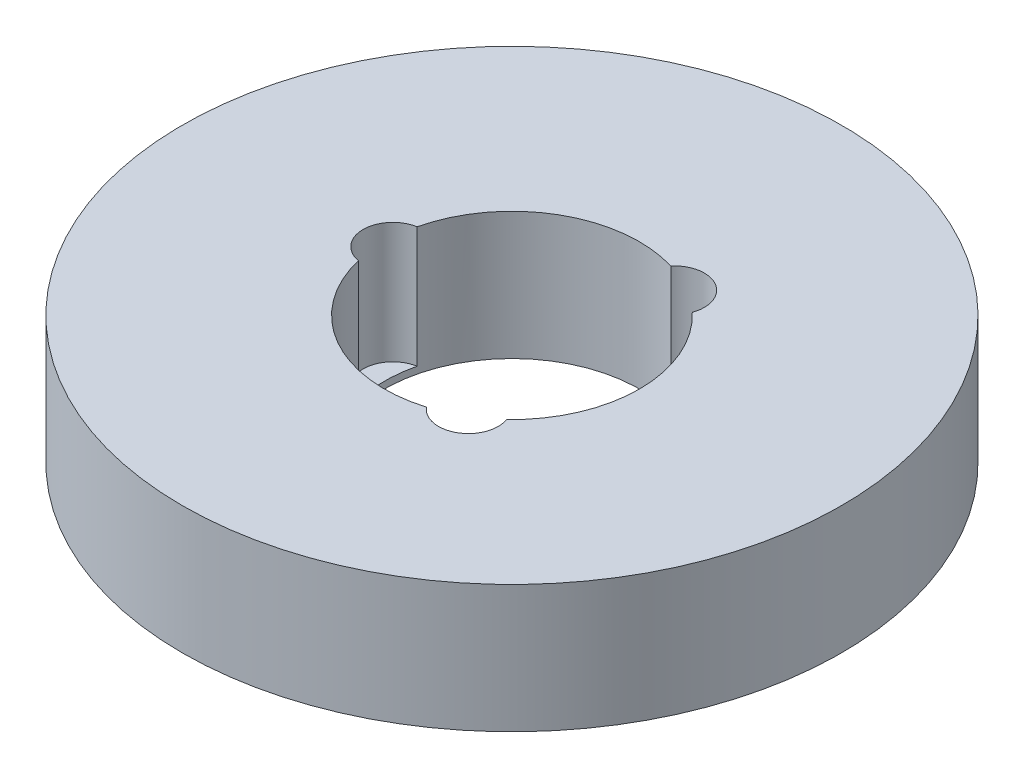
ISO-10303-21;
HEADER;
FILE_DESCRIPTION(('STEP AP214'),'2;1');
FILE_NAME('part.step','',(''),(''),'','','');
FILE_SCHEMA(('AUTOMOTIVE_DESIGN { 1 0 10303 214 1 1 1 1 }'));
ENDSEC;
DATA;
#1=APPLICATION_CONTEXT('core data for automotive mechanical design processes');
#2=APPLICATION_PROTOCOL_DEFINITION('international standard','automotive_design',2000,#1);
#3=PRODUCT_CONTEXT('',#1,'mechanical');
#4=PRODUCT('Part','Part','',(#3));
#5=PRODUCT_RELATED_PRODUCT_CATEGORY('part','',(#4));
#6=PRODUCT_DEFINITION_FORMATION('','',#4);
#7=PRODUCT_DEFINITION_CONTEXT('part definition',#1,'design');
#8=PRODUCT_DEFINITION('design','',#6,#7);
#9=PRODUCT_DEFINITION_SHAPE('','',#8);
#10=(LENGTH_UNIT() NAMED_UNIT(*) SI_UNIT(.MILLI.,.METRE.));
#11=(NAMED_UNIT(*) PLANE_ANGLE_UNIT() SI_UNIT($,.RADIAN.));
#12=(NAMED_UNIT(*) SI_UNIT($,.STERADIAN.) SOLID_ANGLE_UNIT());
#13=UNCERTAINTY_MEASURE_WITH_UNIT(LENGTH_MEASURE(1.E-05),#10,'distance_accuracy_value','');
#14=(GEOMETRIC_REPRESENTATION_CONTEXT(3) GLOBAL_UNCERTAINTY_ASSIGNED_CONTEXT((#13)) GLOBAL_UNIT_ASSIGNED_CONTEXT((#10,
#11,#12)) REPRESENTATION_CONTEXT('',''));
#15=CARTESIAN_POINT('',(0.,0.,0.));
#16=DIRECTION('',(0.,0.,1.));
#17=DIRECTION('',(1.,0.,0.));
#18=AXIS2_PLACEMENT_3D('',#15,#16,#17);
#19=CARTESIAN_POINT('',(0.,30.,0.));
#20=DIRECTION('',(0.,-1.,0.));
#21=DIRECTION('',(0.,0.,-1.));
#22=AXIS2_PLACEMENT_3D('',#19,#20,#21);
#23=CYLINDRICAL_SURFACE('',#22,77.5);
#24=CARTESIAN_POINT('',(0.,30.,0.));
#25=DIRECTION('',(0.,1.,0.));
#26=DIRECTION('',(0.,0.,1.));
#27=AXIS2_PLACEMENT_3D('',#24,#25,#26);
#28=CIRCLE('',#27,77.5);
#29=CARTESIAN_POINT('',(0.,30.,77.5));
#30=VERTEX_POINT('',#29);
#31=EDGE_CURVE('E130',#30,#30,#28,.T.);
#32=ORIENTED_EDGE('',*,*,#31,.F.);
#33=EDGE_LOOP('',(#32));
#34=FACE_BOUND('',#33,.T.);
#35=CARTESIAN_POINT('',(0.,0.,0.));
#36=DIRECTION('',(0.,1.,0.));
#37=DIRECTION('',(0.,0.,1.));
#38=AXIS2_PLACEMENT_3D('',#35,#36,#37);
#39=CIRCLE('',#38,77.5);
#40=CARTESIAN_POINT('',(0.,0.,77.5));
#41=VERTEX_POINT('',#40);
#42=EDGE_CURVE('E117',#41,#41,#39,.T.);
#43=ORIENTED_EDGE('',*,*,#42,.T.);
#44=EDGE_LOOP('',(#43));
#45=FACE_BOUND('',#44,.T.);
#46=ADVANCED_FACE('F39',(#34,#45),#23,.T.);
#47=CARTESIAN_POINT('',(0.,30.,0.));
#48=DIRECTION('',(0.,1.,0.));
#49=DIRECTION('',(0.,0.,1.));
#50=AXIS2_PLACEMENT_3D('',#47,#48,#49);
#51=PLANE('',#50);
#52=CARTESIAN_POINT('',(13.9946418067197,30.,24.2394306429658));
#53=DIRECTION('',(0.,1.,0.));
#54=DIRECTION('',(0.866025403784436,0.,-0.500000000000004));
#55=AXIS2_PLACEMENT_3D('',#52,#53,#54);
#56=CIRCLE('',#55,7.0085238165134);
#57=CARTESIAN_POINT('',(8.61827400069764,30.,28.7354372378236));
#58=VERTEX_POINT('',#57);
#59=CARTESIAN_POINT('',(20.57648163646,30.,21.8313628402907));
#60=VERTEX_POINT('',#59);
#61=EDGE_CURVE('E148',#58,#60,#56,.T.);
#62=ORIENTED_EDGE('',*,*,#61,.F.);
#63=CARTESIAN_POINT('',(0.,30.,0.));
#64=DIRECTION('',(0.,1.,0.));
#65=DIRECTION('',(0.,0.,1.));
#66=AXIS2_PLACEMENT_3D('',#63,#64,#65);
#67=CIRCLE('',#66,30.);
#68=CARTESIAN_POINT('',(-29.1947556371574,30.,6.90407439753283));
#69=VERTEX_POINT('',#68);
#70=EDGE_CURVE('E113',#69,#58,#67,.T.);
#71=ORIENTED_EDGE('',*,*,#70,.F.);
#72=CARTESIAN_POINT('',(-27.9892836134392,30.,0.));
#73=DIRECTION('',(0.,1.,0.));
#74=DIRECTION('',(0.,0.,1.));
#75=AXIS2_PLACEMENT_3D('',#72,#73,#74);
#76=CIRCLE('',#75,7.0085238165134);
#77=CARTESIAN_POINT('',(-29.1947556371574,30.,-6.90407439753283));
#78=VERTEX_POINT('',#77);
#79=EDGE_CURVE('E125',#78,#69,#76,.T.);
#80=ORIENTED_EDGE('',*,*,#79,.F.);
#81=CARTESIAN_POINT('',(8.61827400069724,30.,-28.7354372378237));
#82=VERTEX_POINT('',#81);
#83=EDGE_CURVE('E107',#82,#78,#67,.T.);
#84=ORIENTED_EDGE('',*,*,#83,.F.);
#85=CARTESIAN_POINT('',(13.9946418067194,30.,-24.239430642966));
#86=DIRECTION('',(0.,1.,0.));
#87=DIRECTION('',(-0.866025403784443,0.,-0.499999999999992));
#88=AXIS2_PLACEMENT_3D('',#85,#86,#87);
#89=CIRCLE('',#88,7.0085238165134);
#90=CARTESIAN_POINT('',(20.5764816364597,30.,-21.831362840291));
#91=VERTEX_POINT('',#90);
#92=EDGE_CURVE('E95',#91,#82,#89,.T.);
#93=ORIENTED_EDGE('',*,*,#92,.F.);
#94=EDGE_CURVE('E106',#60,#91,#67,.T.);
#95=ORIENTED_EDGE('',*,*,#94,.F.);
#96=EDGE_LOOP('',(#62,#71,#80,#84,#93,#95));
#97=FACE_BOUND('',#96,.T.);
#98=ORIENTED_EDGE('',*,*,#31,.T.);
#99=EDGE_LOOP('',(#98));
#100=FACE_BOUND('',#99,.T.);
#101=ADVANCED_FACE('F102',(#97,#100),#51,.T.);
#102=CARTESIAN_POINT('',(0.,0.,0.));
#103=DIRECTION('',(0.,1.,0.));
#104=DIRECTION('',(0.,0.,1.));
#105=AXIS2_PLACEMENT_3D('',#102,#103,#104);
#106=PLANE('',#105);
#107=CARTESIAN_POINT('',(0.,0.,0.));
#108=DIRECTION('',(0.,1.,0.));
#109=DIRECTION('',(0.,0.,1.));
#110=AXIS2_PLACEMENT_3D('',#107,#108,#109);
#111=CIRCLE('',#110,30.);
#112=CARTESIAN_POINT('',(0.,0.,30.));
#113=VERTEX_POINT('',#112);
#114=EDGE_CURVE('E118',#113,#113,#111,.T.);
#115=ORIENTED_EDGE('',*,*,#114,.T.);
#116=EDGE_LOOP('',(#115));
#117=FACE_BOUND('',#116,.T.);
#118=ORIENTED_EDGE('',*,*,#42,.F.);
#119=EDGE_LOOP('',(#118));
#120=FACE_BOUND('',#119,.T.);
#121=ADVANCED_FACE('F161',(#117,#120),#106,.F.);
#122=CARTESIAN_POINT('',(0.,30.,0.));
#123=DIRECTION('',(0.,-1.,0.));
#124=DIRECTION('',(0.,0.,-1.));
#125=AXIS2_PLACEMENT_3D('',#122,#123,#124);
#126=CYLINDRICAL_SURFACE('',#125,30.);
#127=DIRECTION('',(0.,1.,0.));
#128=VECTOR('',#127,1.);
#129=CARTESIAN_POINT('',(8.61827400069764,15.8001131901262,28.7354372378236));
#130=LINE('',#129,#128);
#131=CARTESIAN_POINT('',(8.61827400069764,1.60022638025241,28.7354372378236));
#132=VERTEX_POINT('',#131);
#133=EDGE_CURVE('E11',#132,#58,#130,.T.);
#134=ORIENTED_EDGE('',*,*,#133,.F.);
#135=CARTESIAN_POINT('',(0.,1.60022638025241,0.));
#136=DIRECTION('',(0.,1.,0.));
#137=DIRECTION('',(0.,0.,1.));
#138=AXIS2_PLACEMENT_3D('',#135,#136,#137);
#139=CIRCLE('',#138,30.);
#140=CARTESIAN_POINT('',(20.57648163646,1.60022638025241,21.8313628402907));
#141=VERTEX_POINT('',#140);
#142=EDGE_CURVE('E100',#132,#141,#139,.T.);
#143=ORIENTED_EDGE('',*,*,#142,.T.);
#144=DIRECTION('',(0.,1.,0.));
#145=VECTOR('',#144,1.);
#146=CARTESIAN_POINT('',(20.57648163646,15.8001131901262,21.8313628402907));
#147=LINE('',#146,#145);
#148=EDGE_CURVE('E46',#60,#141,#147,.F.);
#149=ORIENTED_EDGE('',*,*,#148,.F.);
#150=ORIENTED_EDGE('',*,*,#94,.T.);
#151=DIRECTION('',(0.,1.,0.));
#152=VECTOR('',#151,1.);
#153=CARTESIAN_POINT('',(20.5764816364597,15.8001131901262,-21.831362840291));
#154=LINE('',#153,#152);
#155=CARTESIAN_POINT('',(20.5764816364597,1.60022638025241,-21.831362840291));
#156=VERTEX_POINT('',#155);
#157=EDGE_CURVE('E90',#156,#91,#154,.T.);
#158=ORIENTED_EDGE('',*,*,#157,.F.);
#159=CARTESIAN_POINT('',(0.,1.60022638025241,0.));
#160=DIRECTION('',(0.,1.,0.));
#161=DIRECTION('',(0.,0.,1.));
#162=AXIS2_PLACEMENT_3D('',#159,#160,#161);
#163=CIRCLE('',#162,30.);
#164=CARTESIAN_POINT('',(8.61827400069724,1.60022638025241,-28.7354372378237));
#165=VERTEX_POINT('',#164);
#166=EDGE_CURVE('E143',#156,#165,#163,.T.);
#167=ORIENTED_EDGE('',*,*,#166,.T.);
#168=DIRECTION('',(0.,1.,0.));
#169=VECTOR('',#168,1.);
#170=CARTESIAN_POINT('',(8.61827400069724,15.8001131901262,-28.7354372378237));
#171=LINE('',#170,#169);
#172=EDGE_CURVE('E98',#82,#165,#171,.F.);
#173=ORIENTED_EDGE('',*,*,#172,.F.);
#174=ORIENTED_EDGE('',*,*,#83,.T.);
#175=DIRECTION('',(0.,1.,0.));
#176=VECTOR('',#175,1.);
#177=CARTESIAN_POINT('',(-29.1947556371574,15.8001131901262,-6.90407439753283));
#178=LINE('',#177,#176);
#179=CARTESIAN_POINT('',(-29.1947556371574,1.60022638025241,-6.90407439753283));
#180=VERTEX_POINT('',#179);
#181=EDGE_CURVE('E137',#180,#78,#178,.T.);
#182=ORIENTED_EDGE('',*,*,#181,.F.);
#183=CARTESIAN_POINT('',(0.,1.60022638025241,0.));
#184=DIRECTION('',(0.,1.,0.));
#185=DIRECTION('',(0.,0.,1.));
#186=AXIS2_PLACEMENT_3D('',#183,#184,#185);
#187=CIRCLE('',#186,30.);
#188=CARTESIAN_POINT('',(-29.1947556371574,1.60022638025241,6.90407439753283));
#189=VERTEX_POINT('',#188);
#190=EDGE_CURVE('E128',#180,#189,#187,.T.);
#191=ORIENTED_EDGE('',*,*,#190,.T.);
#192=DIRECTION('',(0.,1.,0.));
#193=VECTOR('',#192,1.);
#194=CARTESIAN_POINT('',(-29.1947556371574,15.8001131901262,6.90407439753283));
#195=LINE('',#194,#193);
#196=EDGE_CURVE('E134',#69,#189,#195,.F.);
#197=ORIENTED_EDGE('',*,*,#196,.F.);
#198=ORIENTED_EDGE('',*,*,#70,.T.);
#199=EDGE_LOOP('',(#134,#143,#149,#150,#158,#167,#173,#174,#182,#191,#197,#198));
#200=FACE_BOUND('',#199,.T.);
#201=ORIENTED_EDGE('',*,*,#114,.F.);
#202=EDGE_LOOP('',(#201));
#203=FACE_BOUND('',#202,.T.);
#204=ADVANCED_FACE('F115',(#200,#203),#126,.F.);
#205=CARTESIAN_POINT('',(-27.9892836134392,1.60022638025241,0.));
#206=DIRECTION('',(0.,1.,0.));
#207=DIRECTION('',(0.,0.,1.));
#208=AXIS2_PLACEMENT_3D('',#205,#206,#207);
#209=CYLINDRICAL_SURFACE('',#208,7.0085238165134);
#210=ORIENTED_EDGE('',*,*,#181,.T.);
#211=ORIENTED_EDGE('',*,*,#79,.T.);
#212=ORIENTED_EDGE('',*,*,#196,.T.);
#213=CARTESIAN_POINT('',(-27.9892836134392,1.60022638025241,0.));
#214=DIRECTION('',(0.,1.,0.));
#215=DIRECTION('',(0.,0.,1.));
#216=AXIS2_PLACEMENT_3D('',#213,#214,#215);
#217=CIRCLE('',#216,7.0085238165134);
#218=EDGE_CURVE('E127',#180,#189,#217,.T.);
#219=ORIENTED_EDGE('',*,*,#218,.F.);
#220=EDGE_LOOP('',(#210,#211,#212,#219));
#221=FACE_BOUND('',#220,.T.);
#222=ADVANCED_FACE('F175',(#221),#209,.F.);
#223=CARTESIAN_POINT('',(-27.9892836134392,1.60022638025241,0.));
#224=DIRECTION('',(0.,1.,0.));
#225=DIRECTION('',(0.,0.,1.));
#226=AXIS2_PLACEMENT_3D('',#223,#224,#225);
#227=PLANE('',#226);
#228=ORIENTED_EDGE('',*,*,#218,.T.);
#229=ORIENTED_EDGE('',*,*,#190,.F.);
#230=EDGE_LOOP('',(#228,#229));
#231=FACE_BOUND('',#230,.T.);
#232=ADVANCED_FACE('F176',(#231),#227,.T.);
#233=CARTESIAN_POINT('',(13.9946418067194,1.60022638025241,-24.239430642966));
#234=DIRECTION('',(0.,1.,0.));
#235=DIRECTION('',(0.,0.,1.));
#236=AXIS2_PLACEMENT_3D('',#233,#234,#235);
#237=CYLINDRICAL_SURFACE('',#236,7.0085238165134);
#238=ORIENTED_EDGE('',*,*,#157,.T.);
#239=ORIENTED_EDGE('',*,*,#92,.T.);
#240=ORIENTED_EDGE('',*,*,#172,.T.);
#241=CARTESIAN_POINT('',(13.9946418067194,1.60022638025241,-24.239430642966));
#242=DIRECTION('',(0.,1.,0.));
#243=DIRECTION('',(-0.866025403784443,0.,-0.499999999999992));
#244=AXIS2_PLACEMENT_3D('',#241,#242,#243);
#245=CIRCLE('',#244,7.0085238165134);
#246=EDGE_CURVE('E56',#156,#165,#245,.T.);
#247=ORIENTED_EDGE('',*,*,#246,.F.);
#248=EDGE_LOOP('',(#238,#239,#240,#247));
#249=FACE_BOUND('',#248,.T.);
#250=ADVANCED_FACE('F93',(#249),#237,.F.);
#251=CARTESIAN_POINT('',(13.9946418067194,1.60022638025241,-24.239430642966));
#252=DIRECTION('',(0.,1.,0.));
#253=DIRECTION('',(-0.866025403784443,0.,-0.499999999999992));
#254=AXIS2_PLACEMENT_3D('',#251,#252,#253);
#255=PLANE('',#254);
#256=ORIENTED_EDGE('',*,*,#246,.T.);
#257=ORIENTED_EDGE('',*,*,#166,.F.);
#258=EDGE_LOOP('',(#256,#257));
#259=FACE_BOUND('',#258,.T.);
#260=ADVANCED_FACE('F153',(#259),#255,.T.);
#261=CARTESIAN_POINT('',(13.9946418067197,1.60022638025241,24.2394306429658));
#262=DIRECTION('',(0.,1.,0.));
#263=DIRECTION('',(0.,0.,1.));
#264=AXIS2_PLACEMENT_3D('',#261,#262,#263);
#265=CYLINDRICAL_SURFACE('',#264,7.0085238165134);
#266=ORIENTED_EDGE('',*,*,#133,.T.);
#267=ORIENTED_EDGE('',*,*,#61,.T.);
#268=ORIENTED_EDGE('',*,*,#148,.T.);
#269=CARTESIAN_POINT('',(13.9946418067197,1.60022638025241,24.2394306429658));
#270=DIRECTION('',(0.,1.,0.));
#271=DIRECTION('',(0.866025403784436,0.,-0.500000000000004));
#272=AXIS2_PLACEMENT_3D('',#269,#270,#271);
#273=CIRCLE('',#272,7.0085238165134);
#274=EDGE_CURVE('E55',#132,#141,#273,.T.);
#275=ORIENTED_EDGE('',*,*,#274,.F.);
#276=EDGE_LOOP('',(#266,#267,#268,#275));
#277=FACE_BOUND('',#276,.T.);
#278=ADVANCED_FACE('F144',(#277),#265,.F.);
#279=CARTESIAN_POINT('',(13.9946418067197,1.60022638025241,24.2394306429658));
#280=DIRECTION('',(0.,1.,0.));
#281=DIRECTION('',(0.866025403784436,0.,-0.500000000000004));
#282=AXIS2_PLACEMENT_3D('',#279,#280,#281);
#283=PLANE('',#282);
#284=ORIENTED_EDGE('',*,*,#274,.T.);
#285=ORIENTED_EDGE('',*,*,#142,.F.);
#286=EDGE_LOOP('',(#284,#285));
#287=FACE_BOUND('',#286,.T.);
#288=ADVANCED_FACE('F150',(#287),#283,.T.);
#289=CLOSED_SHELL('',(#46,#101,#121,#204,#222,#232,#250,#260,#278,#288));
#290=MANIFOLD_SOLID_BREP('B2',#289);
#291=ADVANCED_BREP_SHAPE_REPRESENTATION('',(#18,#290),#14);
#292=SHAPE_DEFINITION_REPRESENTATION(#9,#291);
ENDSEC;
END-ISO-10303-21;
